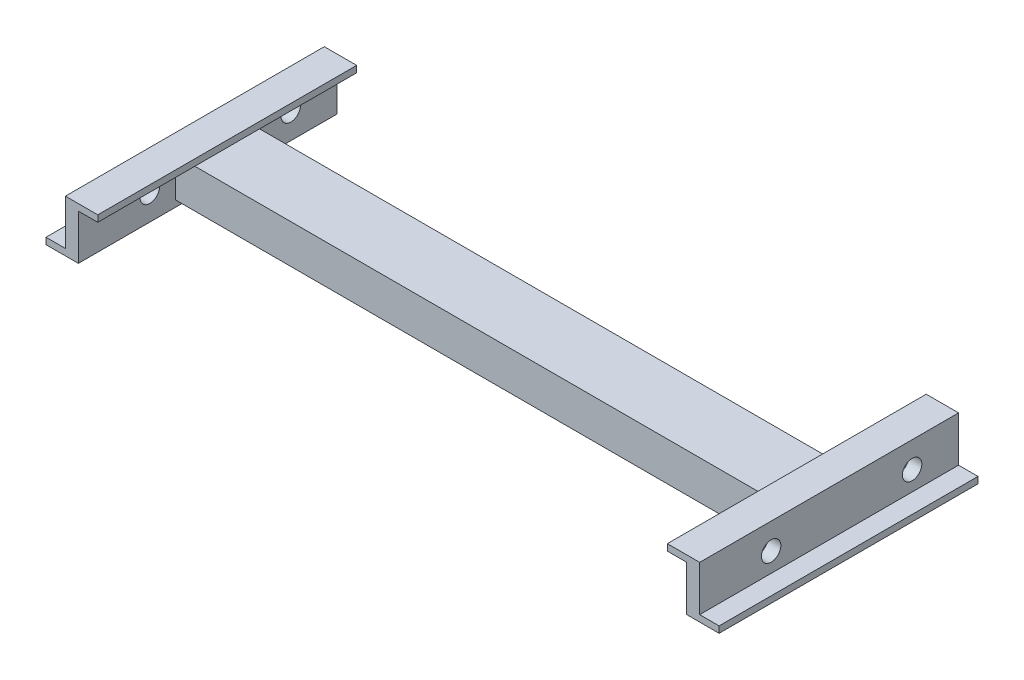
ISO-10303-21;
HEADER;
FILE_DESCRIPTION(('STEP AP214'),'2;1');
FILE_NAME('part.step','',(''),(''),'','','');
FILE_SCHEMA(('AUTOMOTIVE_DESIGN { 1 0 10303 214 1 1 1 1 }'));
ENDSEC;
DATA;
#1=APPLICATION_CONTEXT('core data for automotive mechanical design processes');
#2=APPLICATION_PROTOCOL_DEFINITION('international standard','automotive_design',2000,#1);
#3=PRODUCT_CONTEXT('',#1,'mechanical');
#4=PRODUCT('Part','Part','',(#3));
#5=PRODUCT_RELATED_PRODUCT_CATEGORY('part','',(#4));
#6=PRODUCT_DEFINITION_FORMATION('','',#4);
#7=PRODUCT_DEFINITION_CONTEXT('part definition',#1,'design');
#8=PRODUCT_DEFINITION('design','',#6,#7);
#9=PRODUCT_DEFINITION_SHAPE('','',#8);
#10=(LENGTH_UNIT() NAMED_UNIT(*) SI_UNIT(.MILLI.,.METRE.));
#11=(NAMED_UNIT(*) PLANE_ANGLE_UNIT() SI_UNIT($,.RADIAN.));
#12=(NAMED_UNIT(*) SI_UNIT($,.STERADIAN.) SOLID_ANGLE_UNIT());
#13=UNCERTAINTY_MEASURE_WITH_UNIT(LENGTH_MEASURE(1.E-05),#10,'distance_accuracy_value','');
#14=(GEOMETRIC_REPRESENTATION_CONTEXT(3) GLOBAL_UNCERTAINTY_ASSIGNED_CONTEXT((#13)) GLOBAL_UNIT_ASSIGNED_CONTEXT((#10,
#11,#12)) REPRESENTATION_CONTEXT('',''));
#15=CARTESIAN_POINT('',(0.,0.,0.));
#16=DIRECTION('',(0.,0.,1.));
#17=DIRECTION('',(1.,0.,0.));
#18=AXIS2_PLACEMENT_3D('',#15,#16,#17);
#19=CARTESIAN_POINT('',(470.,-30.,-40.));
#20=DIRECTION('',(0.,0.,-1.));
#21=DIRECTION('',(-1.,0.,0.));
#22=AXIS2_PLACEMENT_3D('',#19,#20,#21);
#23=PLANE('',#22);
#24=DIRECTION('',(0.,1.,0.));
#25=VECTOR('',#24,1.);
#26=CARTESIAN_POINT('',(-940.,20.,-40.));
#27=LINE('',#26,#25);
#28=CARTESIAN_POINT('',(-940.,-30.,-40.));
#29=VERTEX_POINT('',#28);
#30=CARTESIAN_POINT('',(-940.,20.,-40.));
#31=VERTEX_POINT('',#30);
#32=EDGE_CURVE('E220',#29,#31,#27,.T.);
#33=ORIENTED_EDGE('',*,*,#32,.F.);
#34=DIRECTION('',(-1.,0.,0.));
#35=VECTOR('',#34,1.);
#36=CARTESIAN_POINT('',(470.,-30.,-40.));
#37=LINE('',#36,#35);
#38=CARTESIAN_POINT('',(0.,-30.,-40.));
#39=VERTEX_POINT('',#38);
#40=EDGE_CURVE('E231',#39,#29,#37,.T.);
#41=ORIENTED_EDGE('',*,*,#40,.F.);
#42=DIRECTION('',(0.,1.,0.));
#43=VECTOR('',#42,1.);
#44=CARTESIAN_POINT('',(0.,20.,-40.));
#45=LINE('',#44,#43);
#46=CARTESIAN_POINT('',(0.,20.,-40.));
#47=VERTEX_POINT('',#46);
#48=EDGE_CURVE('E349',#39,#47,#45,.T.);
#49=ORIENTED_EDGE('',*,*,#48,.T.);
#50=DIRECTION('',(-1.,0.,0.));
#51=VECTOR('',#50,1.);
#52=CARTESIAN_POINT('',(470.,20.,-40.));
#53=LINE('',#52,#51);
#54=EDGE_CURVE('E240',#47,#31,#53,.T.);
#55=ORIENTED_EDGE('',*,*,#54,.T.);
#56=EDGE_LOOP('',(#33,#41,#49,#55));
#57=FACE_BOUND('',#56,.T.);
#58=ADVANCED_FACE('F38',(#57),#23,.F.);
#59=CARTESIAN_POINT('',(470.,20.,-40.));
#60=DIRECTION('',(0.,1.,0.));
#61=DIRECTION('',(0.,0.,1.));
#62=AXIS2_PLACEMENT_3D('',#59,#60,#61);
#63=PLANE('',#62);
#64=DIRECTION('',(0.,0.,1.));
#65=VECTOR('',#64,1.);
#66=CARTESIAN_POINT('',(-940.,20.,40.));
#67=LINE('',#66,#65);
#68=CARTESIAN_POINT('',(-940.,20.,40.));
#69=VERTEX_POINT('',#68);
#70=EDGE_CURVE('E56',#31,#69,#67,.T.);
#71=ORIENTED_EDGE('',*,*,#70,.F.);
#72=ORIENTED_EDGE('',*,*,#54,.F.);
#73=DIRECTION('',(0.,0.,1.));
#74=VECTOR('',#73,1.);
#75=CARTESIAN_POINT('',(0.,20.,40.));
#76=LINE('',#75,#74);
#77=CARTESIAN_POINT('',(0.,20.,40.));
#78=VERTEX_POINT('',#77);
#79=EDGE_CURVE('E238',#47,#78,#76,.T.);
#80=ORIENTED_EDGE('',*,*,#79,.T.);
#81=DIRECTION('',(-1.,0.,0.));
#82=VECTOR('',#81,1.);
#83=CARTESIAN_POINT('',(470.,20.,40.));
#84=LINE('',#83,#82);
#85=EDGE_CURVE('E358',#78,#69,#84,.T.);
#86=ORIENTED_EDGE('',*,*,#85,.T.);
#87=EDGE_LOOP('',(#71,#72,#80,#86));
#88=FACE_BOUND('',#87,.T.);
#89=ADVANCED_FACE('F626',(#88),#63,.F.);
#90=CARTESIAN_POINT('',(470.,-30.,40.));
#91=DIRECTION('',(0.,0.,1.));
#92=DIRECTION('',(1.,0.,0.));
#93=AXIS2_PLACEMENT_3D('',#90,#91,#92);
#94=PLANE('',#93);
#95=DIRECTION('',(0.,-1.,0.));
#96=VECTOR('',#95,1.);
#97=CARTESIAN_POINT('',(-940.,20.,40.));
#98=LINE('',#97,#96);
#99=CARTESIAN_POINT('',(-940.,-30.,40.));
#100=VERTEX_POINT('',#99);
#101=EDGE_CURVE('E64',#69,#100,#98,.T.);
#102=ORIENTED_EDGE('',*,*,#101,.F.);
#103=ORIENTED_EDGE('',*,*,#85,.F.);
#104=DIRECTION('',(0.,-1.,0.));
#105=VECTOR('',#104,1.);
#106=CARTESIAN_POINT('',(0.,20.,40.));
#107=LINE('',#106,#105);
#108=CARTESIAN_POINT('',(0.,-30.,40.));
#109=VERTEX_POINT('',#108);
#110=EDGE_CURVE('E346',#78,#109,#107,.T.);
#111=ORIENTED_EDGE('',*,*,#110,.T.);
#112=DIRECTION('',(-1.,0.,0.));
#113=VECTOR('',#112,1.);
#114=CARTESIAN_POINT('',(470.,-30.,40.));
#115=LINE('',#114,#113);
#116=EDGE_CURVE('E237',#109,#100,#115,.T.);
#117=ORIENTED_EDGE('',*,*,#116,.T.);
#118=EDGE_LOOP('',(#102,#103,#111,#117));
#119=FACE_BOUND('',#118,.T.);
#120=ADVANCED_FACE('F631',(#119),#94,.F.);
#121=CARTESIAN_POINT('',(19.9999999999994,-30.,50.));
#122=DIRECTION('',(0.,-1.,0.));
#123=DIRECTION('',(0.,0.,-1.));
#124=AXIS2_PLACEMENT_3D('',#121,#122,#123);
#125=PLANE('',#124);
#126=ORIENTED_EDGE('',*,*,#40,.T.);
#127=DIRECTION('',(0.,0.,-1.));
#128=VECTOR('',#127,1.);
#129=CARTESIAN_POINT('',(-940.,-30.,50.));
#130=LINE('',#129,#128);
#131=CARTESIAN_POINT('',(-940.,-30.,-50.));
#132=VERTEX_POINT('',#131);
#133=EDGE_CURVE('E215',#29,#132,#130,.T.);
#134=ORIENTED_EDGE('',*,*,#133,.T.);
#135=DIRECTION('',(-1.,0.,0.));
#136=VECTOR('',#135,1.);
#137=CARTESIAN_POINT('',(19.9999999999994,-30.,-50.));
#138=LINE('',#137,#136);
#139=CARTESIAN_POINT('',(0.,-30.,-50.));
#140=VERTEX_POINT('',#139);
#141=EDGE_CURVE('E357',#140,#132,#138,.T.);
#142=ORIENTED_EDGE('',*,*,#141,.F.);
#143=DIRECTION('',(0.,0.,-1.));
#144=VECTOR('',#143,1.);
#145=CARTESIAN_POINT('',(0.,-30.,0.));
#146=LINE('',#145,#144);
#147=EDGE_CURVE('E233',#39,#140,#146,.T.);
#148=ORIENTED_EDGE('',*,*,#147,.F.);
#149=EDGE_LOOP('',(#126,#134,#142,#148));
#150=FACE_BOUND('',#149,.T.);
#151=ADVANCED_FACE('F232',(#150),#125,.T.);
#152=CARTESIAN_POINT('',(-940.,-30.,50.));
#153=VERTEX_POINT('',#152);
#154=EDGE_CURVE('E228',#153,#100,#130,.T.);
#155=ORIENTED_EDGE('',*,*,#154,.T.);
#156=ORIENTED_EDGE('',*,*,#116,.F.);
#157=CARTESIAN_POINT('',(0.,-30.,50.));
#158=VERTEX_POINT('',#157);
#159=EDGE_CURVE('E387',#158,#109,#146,.T.);
#160=ORIENTED_EDGE('',*,*,#159,.F.);
#161=DIRECTION('',(-1.,0.,0.));
#162=VECTOR('',#161,1.);
#163=CARTESIAN_POINT('',(19.9999999999994,-30.,50.));
#164=LINE('',#163,#162);
#165=EDGE_CURVE('E373',#158,#153,#164,.T.);
#166=ORIENTED_EDGE('',*,*,#165,.T.);
#167=EDGE_LOOP('',(#155,#156,#160,#166));
#168=FACE_BOUND('',#167,.T.);
#169=ADVANCED_FACE('F512',(#168),#125,.T.);
#170=CARTESIAN_POINT('',(-959.999999999999,0.,0.));
#171=DIRECTION('',(1.,0.,0.));
#172=DIRECTION('',(0.,0.,1.));
#173=AXIS2_PLACEMENT_3D('',#170,#171,#172);
#174=PLANE('',#173);
#175=CARTESIAN_POINT('',(-959.999999999999,0.,-128.216));
#176=DIRECTION('',(-1.,0.,0.));
#177=DIRECTION('',(0.,0.,1.));
#178=AXIS2_PLACEMENT_3D('',#175,#176,#177);
#179=CIRCLE('',#178,15.);
#180=CARTESIAN_POINT('',(-959.999999999999,0.,-113.216));
#181=VERTEX_POINT('',#180);
#182=EDGE_CURVE('E777',#181,#181,#179,.T.);
#183=ORIENTED_EDGE('',*,*,#182,.F.);
#184=EDGE_LOOP('',(#183));
#185=FACE_BOUND('',#184,.T.);
#186=CARTESIAN_POINT('',(-959.999999999999,0.,89.62));
#187=DIRECTION('',(-1.,0.,0.));
#188=DIRECTION('',(0.,0.,1.));
#189=AXIS2_PLACEMENT_3D('',#186,#187,#188);
#190=CIRCLE('',#189,15.);
#191=CARTESIAN_POINT('',(-959.999999999999,0.,104.62));
#192=VERTEX_POINT('',#191);
#193=EDGE_CURVE('E483',#192,#192,#190,.T.);
#194=ORIENTED_EDGE('',*,*,#193,.F.);
#195=EDGE_LOOP('',(#194));
#196=FACE_BOUND('',#195,.T.);
#197=DIRECTION('',(0.,0.,1.));
#198=VECTOR('',#197,1.);
#199=CARTESIAN_POINT('',(-960.,-30.,200.));
#200=LINE('',#199,#198);
#201=CARTESIAN_POINT('',(-960.,-30.,-200.));
#202=VERTEX_POINT('',#201);
#203=CARTESIAN_POINT('',(-960.,-30.,200.));
#204=VERTEX_POINT('',#203);
#205=EDGE_CURVE('E242',#202,#204,#200,.T.);
#206=ORIENTED_EDGE('',*,*,#205,.T.);
#207=DIRECTION('',(0.,1.,0.));
#208=VECTOR('',#207,1.);
#209=CARTESIAN_POINT('',(-960.,-40.,200.));
#210=LINE('',#209,#208);
#211=CARTESIAN_POINT('',(-960.,40.,200.));
#212=VERTEX_POINT('',#211);
#213=EDGE_CURVE('E309',#204,#212,#210,.T.);
#214=ORIENTED_EDGE('',*,*,#213,.T.);
#215=DIRECTION('',(0.,0.,1.));
#216=VECTOR('',#215,1.);
#217=CARTESIAN_POINT('',(-960.,40.,-200.));
#218=LINE('',#217,#216);
#219=CARTESIAN_POINT('',(-960.,40.,-200.));
#220=VERTEX_POINT('',#219);
#221=EDGE_CURVE('E313',#220,#212,#218,.T.);
#222=ORIENTED_EDGE('',*,*,#221,.F.);
#223=DIRECTION('',(0.,1.,0.));
#224=VECTOR('',#223,1.);
#225=CARTESIAN_POINT('',(-960.,-40.,-200.));
#226=LINE('',#225,#224);
#227=EDGE_CURVE('E306',#202,#220,#226,.T.);
#228=ORIENTED_EDGE('',*,*,#227,.F.);
#229=EDGE_LOOP('',(#206,#214,#222,#228));
#230=FACE_BOUND('',#229,.T.);
#231=ADVANCED_FACE('F552',(#185,#196,#230),#174,.F.);
#232=CARTESIAN_POINT('',(19.9999999999994,-30.,-50.));
#233=DIRECTION('',(0.,0.,-1.));
#234=DIRECTION('',(-1.,0.,0.));
#235=AXIS2_PLACEMENT_3D('',#232,#233,#234);
#236=PLANE('',#235);
#237=ORIENTED_EDGE('',*,*,#141,.T.);
#238=DIRECTION('',(0.,1.,0.));
#239=VECTOR('',#238,1.);
#240=CARTESIAN_POINT('',(-940.,-30.,-50.));
#241=LINE('',#240,#239);
#242=CARTESIAN_POINT('',(-940.,30.,-50.));
#243=VERTEX_POINT('',#242);
#244=EDGE_CURVE('E223',#132,#243,#241,.T.);
#245=ORIENTED_EDGE('',*,*,#244,.T.);
#246=DIRECTION('',(-1.,0.,0.));
#247=VECTOR('',#246,1.);
#248=CARTESIAN_POINT('',(19.9999999999994,30.,-50.));
#249=LINE('',#248,#247);
#250=CARTESIAN_POINT('',(-910.,30.,-50.));
#251=VERTEX_POINT('',#250);
#252=EDGE_CURVE('E302',#251,#243,#249,.T.);
#253=ORIENTED_EDGE('',*,*,#252,.F.);
#254=DIRECTION('',(-1.,0.,0.));
#255=VECTOR('',#254,1.);
#256=CARTESIAN_POINT('',(19.9999999999994,30.,-50.));
#257=LINE('',#256,#255);
#258=CARTESIAN_POINT('',(-30.,30.,-50.));
#259=VERTEX_POINT('',#258);
#260=EDGE_CURVE('E363',#259,#251,#257,.T.);
#261=ORIENTED_EDGE('',*,*,#260,.F.);
#262=CARTESIAN_POINT('',(0.,30.,-50.));
#263=VERTEX_POINT('',#262);
#264=EDGE_CURVE('E367',#263,#259,#257,.T.);
#265=ORIENTED_EDGE('',*,*,#264,.F.);
#266=DIRECTION('',(0.,1.,0.));
#267=VECTOR('',#266,1.);
#268=CARTESIAN_POINT('',(0.,0.,-50.));
#269=LINE('',#268,#267);
#270=EDGE_CURVE('E383',#140,#263,#269,.T.);
#271=ORIENTED_EDGE('',*,*,#270,.F.);
#272=EDGE_LOOP('',(#237,#245,#253,#261,#265,#271));
#273=FACE_BOUND('',#272,.T.);
#274=ADVANCED_FACE('F572',(#273),#236,.T.);
#275=CARTESIAN_POINT('',(19.9999999999994,-30.,50.));
#276=DIRECTION('',(0.,0.,1.));
#277=DIRECTION('',(1.,0.,0.));
#278=AXIS2_PLACEMENT_3D('',#275,#276,#277);
#279=PLANE('',#278);
#280=DIRECTION('',(-1.,0.,0.));
#281=VECTOR('',#280,1.);
#282=CARTESIAN_POINT('',(19.9999999999994,30.,50.));
#283=LINE('',#282,#281);
#284=CARTESIAN_POINT('',(-30.,30.,50.));
#285=VERTEX_POINT('',#284);
#286=CARTESIAN_POINT('',(-910.,30.,50.));
#287=VERTEX_POINT('',#286);
#288=EDGE_CURVE('E369',#285,#287,#283,.T.);
#289=ORIENTED_EDGE('',*,*,#288,.T.);
#290=DIRECTION('',(1.,0.,0.));
#291=VECTOR('',#290,1.);
#292=CARTESIAN_POINT('',(19.9999999999994,30.,50.));
#293=LINE('',#292,#291);
#294=CARTESIAN_POINT('',(-940.,30.,50.));
#295=VERTEX_POINT('',#294);
#296=EDGE_CURVE('E299',#295,#287,#293,.T.);
#297=ORIENTED_EDGE('',*,*,#296,.F.);
#298=DIRECTION('',(0.,-1.,0.));
#299=VECTOR('',#298,1.);
#300=CARTESIAN_POINT('',(-940.,-30.,50.));
#301=LINE('',#300,#299);
#302=EDGE_CURVE('E338',#295,#153,#301,.T.);
#303=ORIENTED_EDGE('',*,*,#302,.T.);
#304=ORIENTED_EDGE('',*,*,#165,.F.);
#305=DIRECTION('',(0.,-1.,0.));
#306=VECTOR('',#305,1.);
#307=CARTESIAN_POINT('',(0.,0.,50.));
#308=LINE('',#307,#306);
#309=CARTESIAN_POINT('',(0.,30.,50.));
#310=VERTEX_POINT('',#309);
#311=EDGE_CURVE('E379',#310,#158,#308,.T.);
#312=ORIENTED_EDGE('',*,*,#311,.F.);
#313=EDGE_CURVE('E368',#310,#285,#283,.T.);
#314=ORIENTED_EDGE('',*,*,#313,.T.);
#315=EDGE_LOOP('',(#289,#297,#303,#304,#312,#314));
#316=FACE_BOUND('',#315,.T.);
#317=ADVANCED_FACE('F511',(#316),#279,.T.);
#318=CARTESIAN_POINT('',(19.9999999999994,30.,50.));
#319=DIRECTION('',(0.,1.,0.));
#320=DIRECTION('',(0.,0.,1.));
#321=AXIS2_PLACEMENT_3D('',#318,#319,#320);
#322=PLANE('',#321);
#323=DIRECTION('',(0.,0.,1.));
#324=VECTOR('',#323,1.);
#325=CARTESIAN_POINT('',(-910.,30.,-200.));
#326=LINE('',#325,#324);
#327=EDGE_CURVE('E291',#251,#287,#326,.T.);
#328=ORIENTED_EDGE('',*,*,#327,.T.);
#329=ORIENTED_EDGE('',*,*,#288,.F.);
#330=DIRECTION('',(0.,0.,1.));
#331=VECTOR('',#330,1.);
#332=CARTESIAN_POINT('',(-30.,30.,-200.));
#333=LINE('',#332,#331);
#334=EDGE_CURVE('E428',#259,#285,#333,.T.);
#335=ORIENTED_EDGE('',*,*,#334,.F.);
#336=ORIENTED_EDGE('',*,*,#260,.T.);
#337=EDGE_LOOP('',(#328,#329,#335,#336));
#338=FACE_BOUND('',#337,.T.);
#339=ADVANCED_FACE('F635',(#338),#322,.T.);
#340=CARTESIAN_POINT('',(-30.,30.,-200.));
#341=DIRECTION('',(0.,1.,0.));
#342=DIRECTION('',(0.,0.,1.));
#343=AXIS2_PLACEMENT_3D('',#340,#341,#342);
#344=PLANE('',#343);
#345=DIRECTION('',(0.,0.,1.));
#346=VECTOR('',#345,1.);
#347=CARTESIAN_POINT('',(0.,30.,-200.));
#348=LINE('',#347,#346);
#349=CARTESIAN_POINT('',(0.,30.,-200.));
#350=VERTEX_POINT('',#349);
#351=EDGE_CURVE('E422',#350,#263,#348,.T.);
#352=ORIENTED_EDGE('',*,*,#351,.T.);
#353=ORIENTED_EDGE('',*,*,#264,.T.);
#354=CARTESIAN_POINT('',(-30.,30.,-200.));
#355=VERTEX_POINT('',#354);
#356=EDGE_CURVE('E423',#355,#259,#333,.T.);
#357=ORIENTED_EDGE('',*,*,#356,.F.);
#358=DIRECTION('',(1.,0.,0.));
#359=VECTOR('',#358,1.);
#360=CARTESIAN_POINT('',(-30.,30.,-200.));
#361=LINE('',#360,#359);
#362=EDGE_CURVE('E443',#355,#350,#361,.T.);
#363=ORIENTED_EDGE('',*,*,#362,.T.);
#364=EDGE_LOOP('',(#352,#353,#357,#363));
#365=FACE_BOUND('',#364,.T.);
#366=ADVANCED_FACE('F578',(#365),#344,.F.);
#367=CARTESIAN_POINT('',(0.,0.,0.));
#368=DIRECTION('',(1.,0.,0.));
#369=DIRECTION('',(0.,0.,-1.));
#370=AXIS2_PLACEMENT_3D('',#367,#368,#369);
#371=PLANE('',#370);
#372=CARTESIAN_POINT('',(0.,0.,-128.216));
#373=DIRECTION('',(1.,0.,0.));
#374=DIRECTION('',(0.,0.,-1.));
#375=AXIS2_PLACEMENT_3D('',#372,#373,#374);
#376=CIRCLE('',#375,15.);
#377=CARTESIAN_POINT('',(0.,0.,-143.216));
#378=VERTEX_POINT('',#377);
#379=EDGE_CURVE('E492',#378,#378,#376,.T.);
#380=ORIENTED_EDGE('',*,*,#379,.T.);
#381=EDGE_LOOP('',(#380));
#382=FACE_BOUND('',#381,.T.);
#383=CARTESIAN_POINT('',(0.,0.,89.62));
#384=DIRECTION('',(1.,0.,0.));
#385=DIRECTION('',(0.,0.,-1.));
#386=AXIS2_PLACEMENT_3D('',#383,#384,#385);
#387=CIRCLE('',#386,15.);
#388=CARTESIAN_POINT('',(0.,0.,74.62));
#389=VERTEX_POINT('',#388);
#390=EDGE_CURVE('E489',#389,#389,#387,.T.);
#391=ORIENTED_EDGE('',*,*,#390,.T.);
#392=EDGE_LOOP('',(#391));
#393=FACE_BOUND('',#392,.T.);
#394=ORIENTED_EDGE('',*,*,#159,.T.);
#395=ORIENTED_EDGE('',*,*,#110,.F.);
#396=ORIENTED_EDGE('',*,*,#79,.F.);
#397=ORIENTED_EDGE('',*,*,#48,.F.);
#398=ORIENTED_EDGE('',*,*,#147,.T.);
#399=ORIENTED_EDGE('',*,*,#270,.T.);
#400=ORIENTED_EDGE('',*,*,#351,.F.);
#401=DIRECTION('',(0.,1.,0.));
#402=VECTOR('',#401,1.);
#403=CARTESIAN_POINT('',(0.,-40.,-200.));
#404=LINE('',#403,#402);
#405=CARTESIAN_POINT('',(0.,-40.,-200.));
#406=VERTEX_POINT('',#405);
#407=EDGE_CURVE('E447',#406,#350,#404,.T.);
#408=ORIENTED_EDGE('',*,*,#407,.F.);
#409=DIRECTION('',(0.,0.,1.));
#410=VECTOR('',#409,1.);
#411=CARTESIAN_POINT('',(0.,-40.,-200.));
#412=LINE('',#411,#410);
#413=CARTESIAN_POINT('',(0.,-40.,200.));
#414=VERTEX_POINT('',#413);
#415=EDGE_CURVE('E452',#406,#414,#412,.T.);
#416=ORIENTED_EDGE('',*,*,#415,.T.);
#417=DIRECTION('',(0.,1.,0.));
#418=VECTOR('',#417,1.);
#419=CARTESIAN_POINT('',(0.,-40.,200.));
#420=LINE('',#419,#418);
#421=CARTESIAN_POINT('',(0.,30.,200.));
#422=VERTEX_POINT('',#421);
#423=EDGE_CURVE('E463',#414,#422,#420,.T.);
#424=ORIENTED_EDGE('',*,*,#423,.T.);
#425=EDGE_CURVE('E416',#310,#422,#348,.T.);
#426=ORIENTED_EDGE('',*,*,#425,.F.);
#427=ORIENTED_EDGE('',*,*,#311,.T.);
#428=EDGE_LOOP('',(#394,#395,#396,#397,#398,#399,#400,#408,#416,#424,#426,#427));
#429=FACE_BOUND('',#428,.T.);
#430=ADVANCED_FACE('F515',(#382,#393,#429),#371,.F.);
#431=CARTESIAN_POINT('',(20.,-40.,-200.));
#432=DIRECTION('',(0.,0.,1.));
#433=DIRECTION('',(1.,0.,0.));
#434=AXIS2_PLACEMENT_3D('',#431,#432,#433);
#435=PLANE('',#434);
#436=ORIENTED_EDGE('',*,*,#407,.T.);
#437=ORIENTED_EDGE('',*,*,#362,.F.);
#438=DIRECTION('',(0.,-1.,0.));
#439=VECTOR('',#438,1.);
#440=CARTESIAN_POINT('',(-30.,40.,-200.));
#441=LINE('',#440,#439);
#442=CARTESIAN_POINT('',(-30.,40.,-200.));
#443=VERTEX_POINT('',#442);
#444=EDGE_CURVE('E417',#443,#355,#441,.T.);
#445=ORIENTED_EDGE('',*,*,#444,.F.);
#446=DIRECTION('',(-1.,0.,0.));
#447=VECTOR('',#446,1.);
#448=CARTESIAN_POINT('',(20.,40.,-200.));
#449=LINE('',#448,#447);
#450=CARTESIAN_POINT('',(20.,40.,-200.));
#451=VERTEX_POINT('',#450);
#452=EDGE_CURVE('E48',#451,#443,#449,.T.);
#453=ORIENTED_EDGE('',*,*,#452,.F.);
#454=DIRECTION('',(0.,1.,0.));
#455=VECTOR('',#454,1.);
#456=CARTESIAN_POINT('',(20.,-40.,-200.));
#457=LINE('',#456,#455);
#458=CARTESIAN_POINT('',(20.,-30.,-200.));
#459=VERTEX_POINT('',#458);
#460=EDGE_CURVE('E448',#459,#451,#457,.T.);
#461=ORIENTED_EDGE('',*,*,#460,.F.);
#462=DIRECTION('',(-1.,0.,0.));
#463=VECTOR('',#462,1.);
#464=CARTESIAN_POINT('',(50.,-30.,-200.));
#465=LINE('',#464,#463);
#466=CARTESIAN_POINT('',(50.,-30.,-200.));
#467=VERTEX_POINT('',#466);
#468=EDGE_CURVE('E412',#467,#459,#465,.T.);
#469=ORIENTED_EDGE('',*,*,#468,.F.);
#470=DIRECTION('',(0.,1.,0.));
#471=VECTOR('',#470,1.);
#472=CARTESIAN_POINT('',(50.,-40.,-200.));
#473=LINE('',#472,#471);
#474=CARTESIAN_POINT('',(50.,-40.,-200.));
#475=VERTEX_POINT('',#474);
#476=EDGE_CURVE('E400',#475,#467,#473,.T.);
#477=ORIENTED_EDGE('',*,*,#476,.F.);
#478=DIRECTION('',(-1.,0.,0.));
#479=VECTOR('',#478,1.);
#480=CARTESIAN_POINT('',(20.,-40.,-200.));
#481=LINE('',#480,#479);
#482=EDGE_CURVE('E459',#475,#406,#481,.T.);
#483=ORIENTED_EDGE('',*,*,#482,.T.);
#484=EDGE_LOOP('',(#436,#437,#445,#453,#461,#469,#477,#483));
#485=FACE_BOUND('',#484,.T.);
#486=ADVANCED_FACE('F40',(#485),#435,.F.);
#487=CARTESIAN_POINT('',(20.,40.,-200.));
#488=DIRECTION('',(0.,-1.,0.));
#489=DIRECTION('',(0.,0.,-1.));
#490=AXIS2_PLACEMENT_3D('',#487,#488,#489);
#491=PLANE('',#490);
#492=ORIENTED_EDGE('',*,*,#452,.T.);
#493=DIRECTION('',(0.,0.,-1.));
#494=VECTOR('',#493,1.);
#495=CARTESIAN_POINT('',(-30.,40.,-200.));
#496=LINE('',#495,#494);
#497=CARTESIAN_POINT('',(-30.,40.,200.));
#498=VERTEX_POINT('',#497);
#499=EDGE_CURVE('E432',#498,#443,#496,.T.);
#500=ORIENTED_EDGE('',*,*,#499,.F.);
#501=DIRECTION('',(-1.,0.,0.));
#502=VECTOR('',#501,1.);
#503=CARTESIAN_POINT('',(20.,40.,200.));
#504=LINE('',#503,#502);
#505=CARTESIAN_POINT('',(20.,40.,200.));
#506=VERTEX_POINT('',#505);
#507=EDGE_CURVE('E475',#506,#498,#504,.T.);
#508=ORIENTED_EDGE('',*,*,#507,.F.);
#509=DIRECTION('',(0.,0.,1.));
#510=VECTOR('',#509,1.);
#511=CARTESIAN_POINT('',(20.,40.,-200.));
#512=LINE('',#511,#510);
#513=EDGE_CURVE('E451',#451,#506,#512,.T.);
#514=ORIENTED_EDGE('',*,*,#513,.F.);
#515=EDGE_LOOP('',(#492,#500,#508,#514));
#516=FACE_BOUND('',#515,.T.);
#517=ADVANCED_FACE('F598',(#516),#491,.F.);
#518=CARTESIAN_POINT('',(20.,-40.,200.));
#519=DIRECTION('',(0.,0.,1.));
#520=DIRECTION('',(1.,0.,0.));
#521=AXIS2_PLACEMENT_3D('',#518,#519,#520);
#522=PLANE('',#521);
#523=ORIENTED_EDGE('',*,*,#423,.F.);
#524=DIRECTION('',(-1.,0.,0.));
#525=VECTOR('',#524,1.);
#526=CARTESIAN_POINT('',(20.,-40.,200.));
#527=LINE('',#526,#525);
#528=CARTESIAN_POINT('',(50.,-40.,200.));
#529=VERTEX_POINT('',#528);
#530=EDGE_CURVE('E472',#529,#414,#527,.T.);
#531=ORIENTED_EDGE('',*,*,#530,.F.);
#532=DIRECTION('',(0.,-1.,0.));
#533=VECTOR('',#532,1.);
#534=CARTESIAN_POINT('',(50.,-40.,200.));
#535=LINE('',#534,#533);
#536=CARTESIAN_POINT('',(50.,-30.,200.));
#537=VERTEX_POINT('',#536);
#538=EDGE_CURVE('E392',#537,#529,#535,.T.);
#539=ORIENTED_EDGE('',*,*,#538,.F.);
#540=DIRECTION('',(-1.,0.,0.));
#541=VECTOR('',#540,1.);
#542=CARTESIAN_POINT('',(50.,-30.,200.));
#543=LINE('',#542,#541);
#544=CARTESIAN_POINT('',(20.,-30.,200.));
#545=VERTEX_POINT('',#544);
#546=EDGE_CURVE('E406',#537,#545,#543,.T.);
#547=ORIENTED_EDGE('',*,*,#546,.T.);
#548=DIRECTION('',(0.,1.,0.));
#549=VECTOR('',#548,1.);
#550=CARTESIAN_POINT('',(20.,-40.,200.));
#551=LINE('',#550,#549);
#552=EDGE_CURVE('E456',#545,#506,#551,.T.);
#553=ORIENTED_EDGE('',*,*,#552,.T.);
#554=ORIENTED_EDGE('',*,*,#507,.T.);
#555=DIRECTION('',(0.,1.,0.));
#556=VECTOR('',#555,1.);
#557=CARTESIAN_POINT('',(-30.,40.,200.));
#558=LINE('',#557,#556);
#559=CARTESIAN_POINT('',(-30.,30.,200.));
#560=VERTEX_POINT('',#559);
#561=EDGE_CURVE('E427',#560,#498,#558,.T.);
#562=ORIENTED_EDGE('',*,*,#561,.F.);
#563=DIRECTION('',(1.,0.,0.));
#564=VECTOR('',#563,1.);
#565=CARTESIAN_POINT('',(-30.,30.,200.));
#566=LINE('',#565,#564);
#567=EDGE_CURVE('E436',#560,#422,#566,.T.);
#568=ORIENTED_EDGE('',*,*,#567,.T.);
#569=EDGE_LOOP('',(#523,#531,#539,#547,#553,#554,#562,#568));
#570=FACE_BOUND('',#569,.T.);
#571=ADVANCED_FACE('F591',(#570),#522,.T.);
#572=CARTESIAN_POINT('',(20.,-40.,-200.));
#573=DIRECTION('',(0.,-1.,0.));
#574=DIRECTION('',(0.,0.,-1.));
#575=AXIS2_PLACEMENT_3D('',#572,#573,#574);
#576=PLANE('',#575);
#577=ORIENTED_EDGE('',*,*,#415,.F.);
#578=ORIENTED_EDGE('',*,*,#482,.F.);
#579=DIRECTION('',(0.,0.,-1.));
#580=VECTOR('',#579,1.);
#581=CARTESIAN_POINT('',(50.,-40.,200.));
#582=LINE('',#581,#580);
#583=EDGE_CURVE('E396',#529,#475,#582,.T.);
#584=ORIENTED_EDGE('',*,*,#583,.F.);
#585=ORIENTED_EDGE('',*,*,#530,.T.);
#586=EDGE_LOOP('',(#577,#578,#584,#585));
#587=FACE_BOUND('',#586,.T.);
#588=ADVANCED_FACE('F586',(#587),#576,.T.);
#589=CARTESIAN_POINT('',(20.,0.,0.));
#590=DIRECTION('',(1.,0.,0.));
#591=DIRECTION('',(0.,0.,-1.));
#592=AXIS2_PLACEMENT_3D('',#589,#590,#591);
#593=PLANE('',#592);
#594=CARTESIAN_POINT('',(20.,0.,-128.216));
#595=DIRECTION('',(1.,0.,0.));
#596=DIRECTION('',(0.,0.,-1.));
#597=AXIS2_PLACEMENT_3D('',#594,#595,#596);
#598=CIRCLE('',#597,15.);
#599=CARTESIAN_POINT('',(20.,0.,-143.216));
#600=VERTEX_POINT('',#599);
#601=EDGE_CURVE('E498',#600,#600,#598,.T.);
#602=ORIENTED_EDGE('',*,*,#601,.F.);
#603=EDGE_LOOP('',(#602));
#604=FACE_BOUND('',#603,.T.);
#605=CARTESIAN_POINT('',(20.,0.,89.62));
#606=DIRECTION('',(1.,0.,0.));
#607=DIRECTION('',(0.,0.,-1.));
#608=AXIS2_PLACEMENT_3D('',#605,#606,#607);
#609=CIRCLE('',#608,15.);
#610=CARTESIAN_POINT('',(20.,0.,74.62));
#611=VERTEX_POINT('',#610);
#612=EDGE_CURVE('E482',#611,#611,#609,.T.);
#613=ORIENTED_EDGE('',*,*,#612,.F.);
#614=EDGE_LOOP('',(#613));
#615=FACE_BOUND('',#614,.T.);
#616=ORIENTED_EDGE('',*,*,#552,.F.);
#617=DIRECTION('',(0.,0.,1.));
#618=VECTOR('',#617,1.);
#619=CARTESIAN_POINT('',(20.,-30.,200.));
#620=LINE('',#619,#618);
#621=EDGE_CURVE('E391',#459,#545,#620,.T.);
#622=ORIENTED_EDGE('',*,*,#621,.F.);
#623=ORIENTED_EDGE('',*,*,#460,.T.);
#624=ORIENTED_EDGE('',*,*,#513,.T.);
#625=EDGE_LOOP('',(#616,#622,#623,#624));
#626=FACE_BOUND('',#625,.T.);
#627=ADVANCED_FACE('F610',(#604,#615,#626),#593,.T.);
#628=EDGE_CURVE('E421',#285,#560,#333,.T.);
#629=ORIENTED_EDGE('',*,*,#628,.F.);
#630=ORIENTED_EDGE('',*,*,#313,.F.);
#631=ORIENTED_EDGE('',*,*,#425,.T.);
#632=ORIENTED_EDGE('',*,*,#567,.F.);
#633=EDGE_LOOP('',(#629,#630,#631,#632));
#634=FACE_BOUND('',#633,.T.);
#635=ADVANCED_FACE('F522',(#634),#344,.F.);
#636=CARTESIAN_POINT('',(-30.,0.,0.));
#637=DIRECTION('',(-1.,0.,0.));
#638=DIRECTION('',(0.,0.,1.));
#639=AXIS2_PLACEMENT_3D('',#636,#637,#638);
#640=PLANE('',#639);
#641=ORIENTED_EDGE('',*,*,#444,.T.);
#642=ORIENTED_EDGE('',*,*,#356,.T.);
#643=ORIENTED_EDGE('',*,*,#334,.T.);
#644=ORIENTED_EDGE('',*,*,#628,.T.);
#645=ORIENTED_EDGE('',*,*,#561,.T.);
#646=ORIENTED_EDGE('',*,*,#499,.T.);
#647=EDGE_LOOP('',(#641,#642,#643,#644,#645,#646));
#648=FACE_BOUND('',#647,.T.);
#649=ADVANCED_FACE('F596',(#648),#640,.T.);
#650=CARTESIAN_POINT('',(50.,-30.,200.));
#651=DIRECTION('',(0.,-1.,0.));
#652=DIRECTION('',(0.,0.,-1.));
#653=AXIS2_PLACEMENT_3D('',#650,#651,#652);
#654=PLANE('',#653);
#655=ORIENTED_EDGE('',*,*,#621,.T.);
#656=ORIENTED_EDGE('',*,*,#546,.F.);
#657=DIRECTION('',(0.,0.,1.));
#658=VECTOR('',#657,1.);
#659=CARTESIAN_POINT('',(50.,-30.,200.));
#660=LINE('',#659,#658);
#661=EDGE_CURVE('E403',#467,#537,#660,.T.);
#662=ORIENTED_EDGE('',*,*,#661,.F.);
#663=ORIENTED_EDGE('',*,*,#468,.T.);
#664=EDGE_LOOP('',(#655,#656,#662,#663));
#665=FACE_BOUND('',#664,.T.);
#666=ADVANCED_FACE('F605',(#665),#654,.F.);
#667=CARTESIAN_POINT('',(50.,0.,0.));
#668=DIRECTION('',(-1.,0.,0.));
#669=DIRECTION('',(0.,0.,1.));
#670=AXIS2_PLACEMENT_3D('',#667,#668,#669);
#671=PLANE('',#670);
#672=ORIENTED_EDGE('',*,*,#538,.T.);
#673=ORIENTED_EDGE('',*,*,#583,.T.);
#674=ORIENTED_EDGE('',*,*,#476,.T.);
#675=ORIENTED_EDGE('',*,*,#661,.T.);
#676=EDGE_LOOP('',(#672,#673,#674,#675));
#677=FACE_BOUND('',#676,.T.);
#678=ADVANCED_FACE('F609',(#677),#671,.F.);
#679=CARTESIAN_POINT('',(-960.,-40.,-200.));
#680=DIRECTION('',(0.,0.,-1.));
#681=DIRECTION('',(-1.,0.,0.));
#682=AXIS2_PLACEMENT_3D('',#679,#680,#681);
#683=PLANE('',#682);
#684=DIRECTION('',(0.,1.,0.));
#685=VECTOR('',#684,1.);
#686=CARTESIAN_POINT('',(-940.,-40.,-200.));
#687=LINE('',#686,#685);
#688=CARTESIAN_POINT('',(-940.,-40.,-200.));
#689=VERTEX_POINT('',#688);
#690=CARTESIAN_POINT('',(-940.,30.,-200.));
#691=VERTEX_POINT('',#690);
#692=EDGE_CURVE('E305',#689,#691,#687,.T.);
#693=ORIENTED_EDGE('',*,*,#692,.F.);
#694=DIRECTION('',(1.,0.,0.));
#695=VECTOR('',#694,1.);
#696=CARTESIAN_POINT('',(-960.,-40.,-200.));
#697=LINE('',#696,#695);
#698=CARTESIAN_POINT('',(-990.,-40.,-200.));
#699=VERTEX_POINT('',#698);
#700=EDGE_CURVE('E335',#699,#689,#697,.T.);
#701=ORIENTED_EDGE('',*,*,#700,.F.);
#702=DIRECTION('',(0.,1.,0.));
#703=VECTOR('',#702,1.);
#704=CARTESIAN_POINT('',(-990.,-40.,-200.));
#705=LINE('',#704,#703);
#706=CARTESIAN_POINT('',(-990.,-30.,-200.));
#707=VERTEX_POINT('',#706);
#708=EDGE_CURVE('E257',#699,#707,#705,.T.);
#709=ORIENTED_EDGE('',*,*,#708,.T.);
#710=DIRECTION('',(1.,0.,0.));
#711=VECTOR('',#710,1.);
#712=CARTESIAN_POINT('',(-990.,-30.,-200.));
#713=LINE('',#712,#711);
#714=EDGE_CURVE('E264',#707,#202,#713,.T.);
#715=ORIENTED_EDGE('',*,*,#714,.T.);
#716=ORIENTED_EDGE('',*,*,#227,.T.);
#717=DIRECTION('',(1.,0.,0.));
#718=VECTOR('',#717,1.);
#719=CARTESIAN_POINT('',(-960.,40.,-200.));
#720=LINE('',#719,#718);
#721=CARTESIAN_POINT('',(-910.,40.,-200.));
#722=VERTEX_POINT('',#721);
#723=EDGE_CURVE('E317',#220,#722,#720,.T.);
#724=ORIENTED_EDGE('',*,*,#723,.T.);
#725=DIRECTION('',(0.,-1.,0.));
#726=VECTOR('',#725,1.);
#727=CARTESIAN_POINT('',(-910.,40.,-200.));
#728=LINE('',#727,#726);
#729=CARTESIAN_POINT('',(-910.,30.,-200.));
#730=VERTEX_POINT('',#729);
#731=EDGE_CURVE('E273',#722,#730,#728,.T.);
#732=ORIENTED_EDGE('',*,*,#731,.T.);
#733=DIRECTION('',(-1.,0.,0.));
#734=VECTOR('',#733,1.);
#735=CARTESIAN_POINT('',(-910.,30.,-200.));
#736=LINE('',#735,#734);
#737=EDGE_CURVE('E290',#730,#691,#736,.T.);
#738=ORIENTED_EDGE('',*,*,#737,.T.);
#739=EDGE_LOOP('',(#693,#701,#709,#715,#716,#724,#732,#738));
#740=FACE_BOUND('',#739,.T.);
#741=ADVANCED_FACE('F564',(#740),#683,.T.);
#742=CARTESIAN_POINT('',(-960.,-40.,-200.));
#743=DIRECTION('',(0.,1.,0.));
#744=DIRECTION('',(0.,0.,1.));
#745=AXIS2_PLACEMENT_3D('',#742,#743,#744);
#746=PLANE('',#745);
#747=DIRECTION('',(0.,0.,1.));
#748=VECTOR('',#747,1.);
#749=CARTESIAN_POINT('',(-940.,-40.,-200.));
#750=LINE('',#749,#748);
#751=CARTESIAN_POINT('',(-940.,-40.,200.));
#752=VERTEX_POINT('',#751);
#753=EDGE_CURVE('E320',#689,#752,#750,.T.);
#754=ORIENTED_EDGE('',*,*,#753,.T.);
#755=DIRECTION('',(1.,0.,0.));
#756=VECTOR('',#755,1.);
#757=CARTESIAN_POINT('',(-960.,-40.,200.));
#758=LINE('',#757,#756);
#759=CARTESIAN_POINT('',(-990.,-40.,200.));
#760=VERTEX_POINT('',#759);
#761=EDGE_CURVE('E331',#760,#752,#758,.T.);
#762=ORIENTED_EDGE('',*,*,#761,.F.);
#763=DIRECTION('',(0.,0.,-1.));
#764=VECTOR('',#763,1.);
#765=CARTESIAN_POINT('',(-990.,-40.,200.));
#766=LINE('',#765,#764);
#767=EDGE_CURVE('E261',#760,#699,#766,.T.);
#768=ORIENTED_EDGE('',*,*,#767,.T.);
#769=ORIENTED_EDGE('',*,*,#700,.T.);
#770=EDGE_LOOP('',(#754,#762,#768,#769));
#771=FACE_BOUND('',#770,.T.);
#772=ADVANCED_FACE('F567',(#771),#746,.F.);
#773=CARTESIAN_POINT('',(-960.,-40.,200.));
#774=DIRECTION('',(0.,0.,-1.));
#775=DIRECTION('',(-1.,0.,0.));
#776=AXIS2_PLACEMENT_3D('',#773,#774,#775);
#777=PLANE('',#776);
#778=DIRECTION('',(0.,1.,0.));
#779=VECTOR('',#778,1.);
#780=CARTESIAN_POINT('',(-940.,-40.,200.));
#781=LINE('',#780,#779);
#782=CARTESIAN_POINT('',(-940.,30.,200.));
#783=VERTEX_POINT('',#782);
#784=EDGE_CURVE('E310',#752,#783,#781,.T.);
#785=ORIENTED_EDGE('',*,*,#784,.T.);
#786=DIRECTION('',(-1.,0.,0.));
#787=VECTOR('',#786,1.);
#788=CARTESIAN_POINT('',(-910.,30.,200.));
#789=LINE('',#788,#787);
#790=CARTESIAN_POINT('',(-910.,30.,200.));
#791=VERTEX_POINT('',#790);
#792=EDGE_CURVE('E296',#791,#783,#789,.T.);
#793=ORIENTED_EDGE('',*,*,#792,.F.);
#794=DIRECTION('',(0.,1.,0.));
#795=VECTOR('',#794,1.);
#796=CARTESIAN_POINT('',(-910.,40.,200.));
#797=LINE('',#796,#795);
#798=CARTESIAN_POINT('',(-910.,40.,200.));
#799=VERTEX_POINT('',#798);
#800=EDGE_CURVE('E281',#791,#799,#797,.T.);
#801=ORIENTED_EDGE('',*,*,#800,.T.);
#802=DIRECTION('',(1.,0.,0.));
#803=VECTOR('',#802,1.);
#804=CARTESIAN_POINT('',(-960.,40.,200.));
#805=LINE('',#804,#803);
#806=EDGE_CURVE('E328',#212,#799,#805,.T.);
#807=ORIENTED_EDGE('',*,*,#806,.F.);
#808=ORIENTED_EDGE('',*,*,#213,.F.);
#809=DIRECTION('',(1.,0.,0.));
#810=VECTOR('',#809,1.);
#811=CARTESIAN_POINT('',(-990.,-30.,200.));
#812=LINE('',#811,#810);
#813=CARTESIAN_POINT('',(-990.,-30.,200.));
#814=VERTEX_POINT('',#813);
#815=EDGE_CURVE('E268',#814,#204,#812,.T.);
#816=ORIENTED_EDGE('',*,*,#815,.F.);
#817=DIRECTION('',(0.,-1.,0.));
#818=VECTOR('',#817,1.);
#819=CARTESIAN_POINT('',(-990.,-40.,200.));
#820=LINE('',#819,#818);
#821=EDGE_CURVE('E246',#814,#760,#820,.T.);
#822=ORIENTED_EDGE('',*,*,#821,.T.);
#823=ORIENTED_EDGE('',*,*,#761,.T.);
#824=EDGE_LOOP('',(#785,#793,#801,#807,#808,#816,#822,#823));
#825=FACE_BOUND('',#824,.T.);
#826=ADVANCED_FACE('F537',(#825),#777,.F.);
#827=CARTESIAN_POINT('',(-960.,40.,-200.));
#828=DIRECTION('',(0.,1.,0.));
#829=DIRECTION('',(0.,0.,1.));
#830=AXIS2_PLACEMENT_3D('',#827,#828,#829);
#831=PLANE('',#830);
#832=ORIENTED_EDGE('',*,*,#806,.T.);
#833=DIRECTION('',(0.,0.,-1.));
#834=VECTOR('',#833,1.);
#835=CARTESIAN_POINT('',(-910.,40.,-200.));
#836=LINE('',#835,#834);
#837=EDGE_CURVE('E277',#799,#722,#836,.T.);
#838=ORIENTED_EDGE('',*,*,#837,.T.);
#839=ORIENTED_EDGE('',*,*,#723,.F.);
#840=ORIENTED_EDGE('',*,*,#221,.T.);
#841=EDGE_LOOP('',(#832,#838,#839,#840));
#842=FACE_BOUND('',#841,.T.);
#843=ADVANCED_FACE('F546',(#842),#831,.T.);
#844=CARTESIAN_POINT('',(-940.,0.,0.));
#845=DIRECTION('',(-1.,0.,0.));
#846=DIRECTION('',(0.,0.,-1.));
#847=AXIS2_PLACEMENT_3D('',#844,#845,#846);
#848=PLANE('',#847);
#849=CARTESIAN_POINT('',(-940.,0.,-128.216));
#850=DIRECTION('',(-1.,0.,0.));
#851=DIRECTION('',(0.,0.,1.));
#852=AXIS2_PLACEMENT_3D('',#849,#850,#851);
#853=CIRCLE('',#852,15.);
#854=CARTESIAN_POINT('',(-940.,0.,-113.216));
#855=VERTEX_POINT('',#854);
#856=EDGE_CURVE('E42',#855,#855,#853,.T.);
#857=ORIENTED_EDGE('',*,*,#856,.T.);
#858=EDGE_LOOP('',(#857));
#859=FACE_BOUND('',#858,.T.);
#860=CARTESIAN_POINT('',(-940.,0.,89.62));
#861=DIRECTION('',(-1.,0.,0.));
#862=DIRECTION('',(0.,0.,1.));
#863=AXIS2_PLACEMENT_3D('',#860,#861,#862);
#864=CIRCLE('',#863,15.);
#865=CARTESIAN_POINT('',(-940.,0.,104.62));
#866=VERTEX_POINT('',#865);
#867=EDGE_CURVE('E479',#866,#866,#864,.T.);
#868=ORIENTED_EDGE('',*,*,#867,.T.);
#869=EDGE_LOOP('',(#868));
#870=FACE_BOUND('',#869,.T.);
#871=ORIENTED_EDGE('',*,*,#692,.T.);
#872=DIRECTION('',(0.,0.,1.));
#873=VECTOR('',#872,1.);
#874=CARTESIAN_POINT('',(-940.,30.,-200.));
#875=LINE('',#874,#873);
#876=EDGE_CURVE('E272',#691,#243,#875,.T.);
#877=ORIENTED_EDGE('',*,*,#876,.T.);
#878=ORIENTED_EDGE('',*,*,#244,.F.);
#879=ORIENTED_EDGE('',*,*,#133,.F.);
#880=ORIENTED_EDGE('',*,*,#32,.T.);
#881=ORIENTED_EDGE('',*,*,#70,.T.);
#882=ORIENTED_EDGE('',*,*,#101,.T.);
#883=ORIENTED_EDGE('',*,*,#154,.F.);
#884=ORIENTED_EDGE('',*,*,#302,.F.);
#885=DIRECTION('',(0.,0.,1.));
#886=VECTOR('',#885,1.);
#887=CARTESIAN_POINT('',(-940.,30.,0.));
#888=LINE('',#887,#886);
#889=EDGE_CURVE('E11',#295,#783,#888,.T.);
#890=ORIENTED_EDGE('',*,*,#889,.T.);
#891=ORIENTED_EDGE('',*,*,#784,.F.);
#892=ORIENTED_EDGE('',*,*,#753,.F.);
#893=EDGE_LOOP('',(#871,#877,#878,#879,#880,#881,#882,#883,#884,#890,#891,#892));
#894=FACE_BOUND('',#893,.T.);
#895=ADVANCED_FACE('F218',(#859,#870,#894),#848,.F.);
#896=CARTESIAN_POINT('',(-910.,30.,-200.));
#897=DIRECTION('',(0.,-1.,0.));
#898=DIRECTION('',(0.,0.,-1.));
#899=AXIS2_PLACEMENT_3D('',#896,#897,#898);
#900=PLANE('',#899);
#901=EDGE_CURVE('E286',#730,#251,#326,.T.);
#902=ORIENTED_EDGE('',*,*,#901,.T.);
#903=ORIENTED_EDGE('',*,*,#252,.T.);
#904=ORIENTED_EDGE('',*,*,#876,.F.);
#905=ORIENTED_EDGE('',*,*,#737,.F.);
#906=EDGE_LOOP('',(#902,#903,#904,#905));
#907=FACE_BOUND('',#906,.T.);
#908=ADVANCED_FACE('F694',(#907),#900,.T.);
#909=ORIENTED_EDGE('',*,*,#889,.F.);
#910=ORIENTED_EDGE('',*,*,#296,.T.);
#911=EDGE_CURVE('E285',#287,#791,#326,.T.);
#912=ORIENTED_EDGE('',*,*,#911,.T.);
#913=ORIENTED_EDGE('',*,*,#792,.T.);
#914=EDGE_LOOP('',(#909,#910,#912,#913));
#915=FACE_BOUND('',#914,.T.);
#916=ADVANCED_FACE('F533',(#915),#900,.T.);
#917=CARTESIAN_POINT('',(-910.,0.,0.));
#918=DIRECTION('',(1.,0.,0.));
#919=DIRECTION('',(0.,0.,1.));
#920=AXIS2_PLACEMENT_3D('',#917,#918,#919);
#921=PLANE('',#920);
#922=ORIENTED_EDGE('',*,*,#731,.F.);
#923=ORIENTED_EDGE('',*,*,#837,.F.);
#924=ORIENTED_EDGE('',*,*,#800,.F.);
#925=ORIENTED_EDGE('',*,*,#911,.F.);
#926=ORIENTED_EDGE('',*,*,#327,.F.);
#927=ORIENTED_EDGE('',*,*,#901,.F.);
#928=EDGE_LOOP('',(#922,#923,#924,#925,#926,#927));
#929=FACE_BOUND('',#928,.T.);
#930=ADVANCED_FACE('F542',(#929),#921,.T.);
#931=CARTESIAN_POINT('',(-990.,-30.,200.));
#932=DIRECTION('',(0.,1.,0.));
#933=DIRECTION('',(0.,0.,1.));
#934=AXIS2_PLACEMENT_3D('',#931,#932,#933);
#935=PLANE('',#934);
#936=ORIENTED_EDGE('',*,*,#815,.T.);
#937=ORIENTED_EDGE('',*,*,#205,.F.);
#938=ORIENTED_EDGE('',*,*,#714,.F.);
#939=DIRECTION('',(0.,0.,1.));
#940=VECTOR('',#939,1.);
#941=CARTESIAN_POINT('',(-990.,-30.,200.));
#942=LINE('',#941,#940);
#943=EDGE_CURVE('E254',#707,#814,#942,.T.);
#944=ORIENTED_EDGE('',*,*,#943,.T.);
#945=EDGE_LOOP('',(#936,#937,#938,#944));
#946=FACE_BOUND('',#945,.T.);
#947=ADVANCED_FACE('F556',(#946),#935,.T.);
#948=CARTESIAN_POINT('',(-990.,0.,0.));
#949=DIRECTION('',(1.,0.,0.));
#950=DIRECTION('',(0.,0.,1.));
#951=AXIS2_PLACEMENT_3D('',#948,#949,#950);
#952=PLANE('',#951);
#953=ORIENTED_EDGE('',*,*,#821,.F.);
#954=ORIENTED_EDGE('',*,*,#943,.F.);
#955=ORIENTED_EDGE('',*,*,#708,.F.);
#956=ORIENTED_EDGE('',*,*,#767,.F.);
#957=EDGE_LOOP('',(#953,#954,#955,#956));
#958=FACE_BOUND('',#957,.T.);
#959=ADVANCED_FACE('F560',(#958),#952,.F.);
#960=CARTESIAN_POINT('',(49.9999999999999,0.,89.62));
#961=DIRECTION('',(-1.,0.,0.));
#962=DIRECTION('',(0.,0.,1.));
#963=AXIS2_PLACEMENT_3D('',#960,#961,#962);
#964=CYLINDRICAL_SURFACE('',#963,15.);
#965=ORIENTED_EDGE('',*,*,#193,.T.);
#966=EDGE_LOOP('',(#965));
#967=FACE_BOUND('',#966,.T.);
#968=ORIENTED_EDGE('',*,*,#867,.F.);
#969=EDGE_LOOP('',(#968));
#970=FACE_BOUND('',#969,.T.);
#971=ADVANCED_FACE('F729',(#967,#970),#964,.F.);
#972=ORIENTED_EDGE('',*,*,#612,.T.);
#973=EDGE_LOOP('',(#972));
#974=FACE_BOUND('',#973,.T.);
#975=ORIENTED_EDGE('',*,*,#390,.F.);
#976=EDGE_LOOP('',(#975));
#977=FACE_BOUND('',#976,.T.);
#978=ADVANCED_FACE('F736',(#974,#977),#964,.F.);
#979=CARTESIAN_POINT('',(49.9999999999999,0.,-128.216));
#980=DIRECTION('',(-1.,0.,0.));
#981=DIRECTION('',(0.,0.,1.));
#982=AXIS2_PLACEMENT_3D('',#979,#980,#981);
#983=CYLINDRICAL_SURFACE('',#982,15.);
#984=ORIENTED_EDGE('',*,*,#182,.T.);
#985=EDGE_LOOP('',(#984));
#986=FACE_BOUND('',#985,.T.);
#987=ORIENTED_EDGE('',*,*,#856,.F.);
#988=EDGE_LOOP('',(#987));
#989=FACE_BOUND('',#988,.T.);
#990=ADVANCED_FACE('F742',(#986,#989),#983,.F.);
#991=ORIENTED_EDGE('',*,*,#601,.T.);
#992=EDGE_LOOP('',(#991));
#993=FACE_BOUND('',#992,.T.);
#994=ORIENTED_EDGE('',*,*,#379,.F.);
#995=EDGE_LOOP('',(#994));
#996=FACE_BOUND('',#995,.T.);
#997=ADVANCED_FACE('F749',(#993,#996),#983,.F.);
#998=CLOSED_SHELL('',(#58,#89,#120,#151,#169,#231,#274,#317,#339,#366,#430,#486,#517,#571,#588,
#627,#635,#649,#666,#678,#741,#772,#826,#843,#895,#908,#916,#930,#947,#959,#971,#978,#990,#997));
#999=MANIFOLD_SOLID_BREP('B2',#998);
#1000=ADVANCED_BREP_SHAPE_REPRESENTATION('',(#18,#999),#14);
#1001=SHAPE_DEFINITION_REPRESENTATION(#9,#1000);
ENDSEC;
END-ISO-10303-21;
